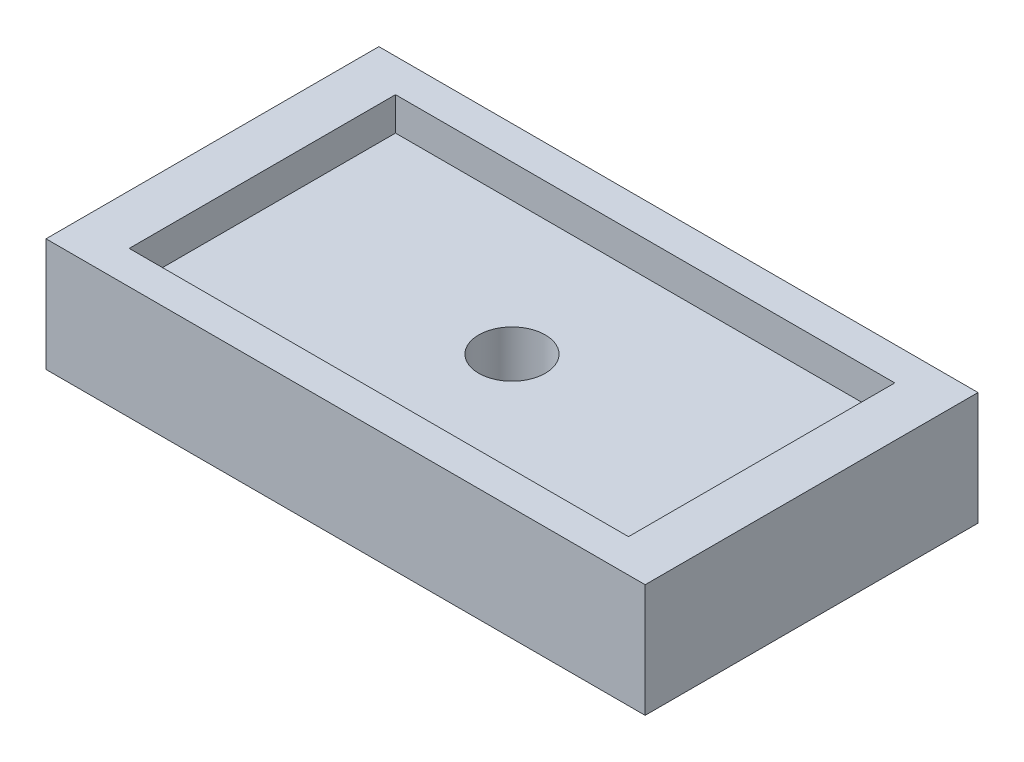
ISO-10303-21;
HEADER;
FILE_DESCRIPTION(('STEP AP214'),'2;1');
FILE_NAME('part.step','',(''),(''),'','','');
FILE_SCHEMA(('AUTOMOTIVE_DESIGN { 1 0 10303 214 1 1 1 1 }'));
ENDSEC;
DATA;
#1=APPLICATION_CONTEXT('core data for automotive mechanical design processes');
#2=APPLICATION_PROTOCOL_DEFINITION('international standard','automotive_design',2000,#1);
#3=PRODUCT_CONTEXT('',#1,'mechanical');
#4=PRODUCT('Part','Part','',(#3));
#5=PRODUCT_RELATED_PRODUCT_CATEGORY('part','',(#4));
#6=PRODUCT_DEFINITION_FORMATION('','',#4);
#7=PRODUCT_DEFINITION_CONTEXT('part definition',#1,'design');
#8=PRODUCT_DEFINITION('design','',#6,#7);
#9=PRODUCT_DEFINITION_SHAPE('','',#8);
#10=(LENGTH_UNIT() NAMED_UNIT(*) SI_UNIT(.MILLI.,.METRE.));
#11=(NAMED_UNIT(*) PLANE_ANGLE_UNIT() SI_UNIT($,.RADIAN.));
#12=(NAMED_UNIT(*) SI_UNIT($,.STERADIAN.) SOLID_ANGLE_UNIT());
#13=UNCERTAINTY_MEASURE_WITH_UNIT(LENGTH_MEASURE(1.E-05),#10,'distance_accuracy_value','');
#14=(GEOMETRIC_REPRESENTATION_CONTEXT(3) GLOBAL_UNCERTAINTY_ASSIGNED_CONTEXT((#13)) GLOBAL_UNIT_ASSIGNED_CONTEXT((#10,
#11,#12)) REPRESENTATION_CONTEXT('',''));
#15=CARTESIAN_POINT('',(0.,0.,0.));
#16=DIRECTION('',(0.,0.,1.));
#17=DIRECTION('',(1.,0.,0.));
#18=AXIS2_PLACEMENT_3D('',#15,#16,#17);
#19=CARTESIAN_POINT('',(0.,17.,0.));
#20=DIRECTION('',(1.,0.,0.));
#21=DIRECTION('',(0.,0.,-1.));
#22=AXIS2_PLACEMENT_3D('',#19,#20,#21);
#23=PLANE('',#22);
#24=DIRECTION('',(0.,0.,1.));
#25=VECTOR('',#24,1.);
#26=CARTESIAN_POINT('',(0.,0.,0.));
#27=LINE('',#26,#25);
#28=CARTESIAN_POINT('',(0.,0.,-50.));
#29=VERTEX_POINT('',#28);
#30=CARTESIAN_POINT('',(0.,0.,0.));
#31=VERTEX_POINT('',#30);
#32=EDGE_CURVE('E146',#29,#31,#27,.T.);
#33=ORIENTED_EDGE('',*,*,#32,.T.);
#34=DIRECTION('',(0.,-1.,0.));
#35=VECTOR('',#34,1.);
#36=CARTESIAN_POINT('',(0.,17.,0.));
#37=LINE('',#36,#35);
#38=CARTESIAN_POINT('',(0.,17.,0.));
#39=VERTEX_POINT('',#38);
#40=EDGE_CURVE('E11',#39,#31,#37,.T.);
#41=ORIENTED_EDGE('',*,*,#40,.F.);
#42=DIRECTION('',(0.,0.,1.));
#43=VECTOR('',#42,1.);
#44=CARTESIAN_POINT('',(0.,17.,0.));
#45=LINE('',#44,#43);
#46=CARTESIAN_POINT('',(0.,17.,-50.));
#47=VERTEX_POINT('',#46);
#48=EDGE_CURVE('E150',#47,#39,#45,.T.);
#49=ORIENTED_EDGE('',*,*,#48,.F.);
#50=DIRECTION('',(0.,-1.,0.));
#51=VECTOR('',#50,1.);
#52=CARTESIAN_POINT('',(0.,17.,-50.));
#53=LINE('',#52,#51);
#54=EDGE_CURVE('E156',#47,#29,#53,.T.);
#55=ORIENTED_EDGE('',*,*,#54,.T.);
#56=EDGE_LOOP('',(#33,#41,#49,#55));
#57=FACE_BOUND('',#56,.T.);
#58=ADVANCED_FACE('F34',(#57),#23,.F.);
#59=CARTESIAN_POINT('',(0.,17.,0.));
#60=DIRECTION('',(0.,0.,-1.));
#61=DIRECTION('',(-1.,0.,0.));
#62=AXIS2_PLACEMENT_3D('',#59,#60,#61);
#63=PLANE('',#62);
#64=DIRECTION('',(1.,0.,0.));
#65=VECTOR('',#64,1.);
#66=CARTESIAN_POINT('',(0.,0.,0.));
#67=LINE('',#66,#65);
#68=CARTESIAN_POINT('',(90.,0.,0.));
#69=VERTEX_POINT('',#68);
#70=EDGE_CURVE('E159',#31,#69,#67,.T.);
#71=ORIENTED_EDGE('',*,*,#70,.T.);
#72=DIRECTION('',(0.,-1.,0.));
#73=VECTOR('',#72,1.);
#74=CARTESIAN_POINT('',(90.,17.,0.));
#75=LINE('',#74,#73);
#76=CARTESIAN_POINT('',(90.,17.,0.));
#77=VERTEX_POINT('',#76);
#78=EDGE_CURVE('E41',#77,#69,#75,.T.);
#79=ORIENTED_EDGE('',*,*,#78,.F.);
#80=DIRECTION('',(1.,0.,0.));
#81=VECTOR('',#80,1.);
#82=CARTESIAN_POINT('',(0.,17.,0.));
#83=LINE('',#82,#81);
#84=EDGE_CURVE('E85',#39,#77,#83,.T.);
#85=ORIENTED_EDGE('',*,*,#84,.F.);
#86=ORIENTED_EDGE('',*,*,#40,.T.);
#87=EDGE_LOOP('',(#71,#79,#85,#86));
#88=FACE_BOUND('',#87,.T.);
#89=ADVANCED_FACE('F188',(#88),#63,.F.);
#90=CARTESIAN_POINT('',(90.,17.,0.));
#91=DIRECTION('',(-1.,0.,0.));
#92=DIRECTION('',(0.,0.,1.));
#93=AXIS2_PLACEMENT_3D('',#90,#91,#92);
#94=PLANE('',#93);
#95=DIRECTION('',(0.,0.,-1.));
#96=VECTOR('',#95,1.);
#97=CARTESIAN_POINT('',(90.,0.,0.));
#98=LINE('',#97,#96);
#99=CARTESIAN_POINT('',(90.,0.,-50.));
#100=VERTEX_POINT('',#99);
#101=EDGE_CURVE('E161',#69,#100,#98,.T.);
#102=ORIENTED_EDGE('',*,*,#101,.T.);
#103=DIRECTION('',(0.,-1.,0.));
#104=VECTOR('',#103,1.);
#105=CARTESIAN_POINT('',(90.,17.,-50.));
#106=LINE('',#105,#104);
#107=CARTESIAN_POINT('',(90.,17.,-50.));
#108=VERTEX_POINT('',#107);
#109=EDGE_CURVE('E165',#108,#100,#106,.T.);
#110=ORIENTED_EDGE('',*,*,#109,.F.);
#111=DIRECTION('',(0.,0.,-1.));
#112=VECTOR('',#111,1.);
#113=CARTESIAN_POINT('',(90.,17.,0.));
#114=LINE('',#113,#112);
#115=EDGE_CURVE('E153',#77,#108,#114,.T.);
#116=ORIENTED_EDGE('',*,*,#115,.F.);
#117=ORIENTED_EDGE('',*,*,#78,.T.);
#118=EDGE_LOOP('',(#102,#110,#116,#117));
#119=FACE_BOUND('',#118,.T.);
#120=ADVANCED_FACE('F170',(#119),#94,.F.);
#121=CARTESIAN_POINT('',(0.,17.,-50.));
#122=DIRECTION('',(0.,0.,1.));
#123=DIRECTION('',(1.,0.,0.));
#124=AXIS2_PLACEMENT_3D('',#121,#122,#123);
#125=PLANE('',#124);
#126=DIRECTION('',(-1.,0.,0.));
#127=VECTOR('',#126,1.);
#128=CARTESIAN_POINT('',(0.,0.,-50.));
#129=LINE('',#128,#127);
#130=EDGE_CURVE('E78',#100,#29,#129,.T.);
#131=ORIENTED_EDGE('',*,*,#130,.T.);
#132=ORIENTED_EDGE('',*,*,#54,.F.);
#133=DIRECTION('',(-1.,0.,0.));
#134=VECTOR('',#133,1.);
#135=CARTESIAN_POINT('',(0.,17.,-50.));
#136=LINE('',#135,#134);
#137=EDGE_CURVE('E57',#108,#47,#136,.T.);
#138=ORIENTED_EDGE('',*,*,#137,.F.);
#139=ORIENTED_EDGE('',*,*,#109,.T.);
#140=EDGE_LOOP('',(#131,#132,#138,#139));
#141=FACE_BOUND('',#140,.T.);
#142=ADVANCED_FACE('F178',(#141),#125,.F.);
#143=CARTESIAN_POINT('',(0.,17.,0.));
#144=DIRECTION('',(0.,-1.,0.));
#145=DIRECTION('',(0.,0.,-1.));
#146=AXIS2_PLACEMENT_3D('',#143,#144,#145);
#147=PLANE('',#146);
#148=DIRECTION('',(1.,0.,0.));
#149=VECTOR('',#148,1.);
#150=CARTESIAN_POINT('',(7.5,17.,-5.));
#151=LINE('',#150,#149);
#152=CARTESIAN_POINT('',(7.5,17.,-5.));
#153=VERTEX_POINT('',#152);
#154=CARTESIAN_POINT('',(82.5,17.,-5.));
#155=VERTEX_POINT('',#154);
#156=EDGE_CURVE('E139',#153,#155,#151,.T.);
#157=ORIENTED_EDGE('',*,*,#156,.F.);
#158=DIRECTION('',(0.,0.,1.));
#159=VECTOR('',#158,1.);
#160=CARTESIAN_POINT('',(7.5,17.,-5.));
#161=LINE('',#160,#159);
#162=CARTESIAN_POINT('',(7.5,17.,-45.));
#163=VERTEX_POINT('',#162);
#164=EDGE_CURVE('E48',#163,#153,#161,.T.);
#165=ORIENTED_EDGE('',*,*,#164,.F.);
#166=DIRECTION('',(-1.,0.,0.));
#167=VECTOR('',#166,1.);
#168=CARTESIAN_POINT('',(7.5,17.,-45.));
#169=LINE('',#168,#167);
#170=CARTESIAN_POINT('',(82.5,17.,-45.));
#171=VERTEX_POINT('',#170);
#172=EDGE_CURVE('E127',#171,#163,#169,.T.);
#173=ORIENTED_EDGE('',*,*,#172,.F.);
#174=DIRECTION('',(0.,0.,-1.));
#175=VECTOR('',#174,1.);
#176=CARTESIAN_POINT('',(82.5,17.,-5.));
#177=LINE('',#176,#175);
#178=EDGE_CURVE('E130',#155,#171,#177,.T.);
#179=ORIENTED_EDGE('',*,*,#178,.F.);
#180=EDGE_LOOP('',(#157,#165,#173,#179));
#181=FACE_BOUND('',#180,.T.);
#182=ORIENTED_EDGE('',*,*,#48,.T.);
#183=ORIENTED_EDGE('',*,*,#84,.T.);
#184=ORIENTED_EDGE('',*,*,#115,.T.);
#185=ORIENTED_EDGE('',*,*,#137,.T.);
#186=EDGE_LOOP('',(#182,#183,#184,#185));
#187=FACE_BOUND('',#186,.T.);
#188=ADVANCED_FACE('F180',(#181,#187),#147,.F.);
#189=CARTESIAN_POINT('',(0.,0.,0.));
#190=DIRECTION('',(0.,-1.,0.));
#191=DIRECTION('',(0.,0.,-1.));
#192=AXIS2_PLACEMENT_3D('',#189,#190,#191);
#193=PLANE('',#192);
#194=CARTESIAN_POINT('',(45.,0.,-25.));
#195=DIRECTION('',(0.,1.,0.));
#196=DIRECTION('',(0.,0.,1.));
#197=AXIS2_PLACEMENT_3D('',#194,#195,#196);
#198=CIRCLE('',#197,5.);
#199=CARTESIAN_POINT('',(45.,0.,-20.));
#200=VERTEX_POINT('',#199);
#201=EDGE_CURVE('E140',#200,#200,#198,.T.);
#202=ORIENTED_EDGE('',*,*,#201,.T.);
#203=EDGE_LOOP('',(#202));
#204=FACE_BOUND('',#203,.T.);
#205=ORIENTED_EDGE('',*,*,#32,.F.);
#206=ORIENTED_EDGE('',*,*,#130,.F.);
#207=ORIENTED_EDGE('',*,*,#101,.F.);
#208=ORIENTED_EDGE('',*,*,#70,.F.);
#209=EDGE_LOOP('',(#205,#206,#207,#208));
#210=FACE_BOUND('',#209,.T.);
#211=ADVANCED_FACE('F174',(#204,#210),#193,.T.);
#212=CARTESIAN_POINT('',(7.5,12.,-5.));
#213=DIRECTION('',(-1.,0.,0.));
#214=DIRECTION('',(0.,0.,1.));
#215=AXIS2_PLACEMENT_3D('',#212,#213,#214);
#216=PLANE('',#215);
#217=ORIENTED_EDGE('',*,*,#164,.T.);
#218=DIRECTION('',(0.,1.,0.));
#219=VECTOR('',#218,1.);
#220=CARTESIAN_POINT('',(7.5,12.,-5.));
#221=LINE('',#220,#219);
#222=CARTESIAN_POINT('',(7.5,12.,-5.));
#223=VERTEX_POINT('',#222);
#224=EDGE_CURVE('E105',#223,#153,#221,.T.);
#225=ORIENTED_EDGE('',*,*,#224,.F.);
#226=DIRECTION('',(0.,0.,1.));
#227=VECTOR('',#226,1.);
#228=CARTESIAN_POINT('',(7.5,12.,-5.));
#229=LINE('',#228,#227);
#230=CARTESIAN_POINT('',(7.5,12.,-45.));
#231=VERTEX_POINT('',#230);
#232=EDGE_CURVE('E109',#231,#223,#229,.T.);
#233=ORIENTED_EDGE('',*,*,#232,.F.);
#234=DIRECTION('',(0.,1.,0.));
#235=VECTOR('',#234,1.);
#236=CARTESIAN_POINT('',(7.5,12.,-45.));
#237=LINE('',#236,#235);
#238=EDGE_CURVE('E144',#231,#163,#237,.T.);
#239=ORIENTED_EDGE('',*,*,#238,.T.);
#240=EDGE_LOOP('',(#217,#225,#233,#239));
#241=FACE_BOUND('',#240,.T.);
#242=ADVANCED_FACE('F107',(#241),#216,.F.);
#243=CARTESIAN_POINT('',(7.5,12.,-45.));
#244=DIRECTION('',(0.,0.,-1.));
#245=DIRECTION('',(-1.,0.,0.));
#246=AXIS2_PLACEMENT_3D('',#243,#244,#245);
#247=PLANE('',#246);
#248=ORIENTED_EDGE('',*,*,#172,.T.);
#249=ORIENTED_EDGE('',*,*,#238,.F.);
#250=DIRECTION('',(-1.,0.,0.));
#251=VECTOR('',#250,1.);
#252=CARTESIAN_POINT('',(7.5,12.,-45.));
#253=LINE('',#252,#251);
#254=CARTESIAN_POINT('',(82.5,12.,-45.));
#255=VERTEX_POINT('',#254);
#256=EDGE_CURVE('E115',#255,#231,#253,.T.);
#257=ORIENTED_EDGE('',*,*,#256,.F.);
#258=DIRECTION('',(0.,1.,0.));
#259=VECTOR('',#258,1.);
#260=CARTESIAN_POINT('',(82.5,12.,-45.));
#261=LINE('',#260,#259);
#262=EDGE_CURVE('E147',#255,#171,#261,.T.);
#263=ORIENTED_EDGE('',*,*,#262,.T.);
#264=EDGE_LOOP('',(#248,#249,#257,#263));
#265=FACE_BOUND('',#264,.T.);
#266=ADVANCED_FACE('F222',(#265),#247,.F.);
#267=CARTESIAN_POINT('',(82.5,12.,-5.));
#268=DIRECTION('',(1.,0.,0.));
#269=DIRECTION('',(0.,0.,-1.));
#270=AXIS2_PLACEMENT_3D('',#267,#268,#269);
#271=PLANE('',#270);
#272=ORIENTED_EDGE('',*,*,#178,.T.);
#273=ORIENTED_EDGE('',*,*,#262,.F.);
#274=DIRECTION('',(0.,0.,-1.));
#275=VECTOR('',#274,1.);
#276=CARTESIAN_POINT('',(82.5,12.,-5.));
#277=LINE('',#276,#275);
#278=CARTESIAN_POINT('',(82.5,12.,-5.));
#279=VERTEX_POINT('',#278);
#280=EDGE_CURVE('E123',#279,#255,#277,.T.);
#281=ORIENTED_EDGE('',*,*,#280,.F.);
#282=DIRECTION('',(0.,1.,0.));
#283=VECTOR('',#282,1.);
#284=CARTESIAN_POINT('',(82.5,12.,-5.));
#285=LINE('',#284,#283);
#286=EDGE_CURVE('E114',#279,#155,#285,.T.);
#287=ORIENTED_EDGE('',*,*,#286,.T.);
#288=EDGE_LOOP('',(#272,#273,#281,#287));
#289=FACE_BOUND('',#288,.T.);
#290=ADVANCED_FACE('F231',(#289),#271,.F.);
#291=CARTESIAN_POINT('',(7.5,12.,-5.));
#292=DIRECTION('',(0.,0.,1.));
#293=DIRECTION('',(1.,0.,0.));
#294=AXIS2_PLACEMENT_3D('',#291,#292,#293);
#295=PLANE('',#294);
#296=ORIENTED_EDGE('',*,*,#156,.T.);
#297=ORIENTED_EDGE('',*,*,#286,.F.);
#298=DIRECTION('',(1.,0.,0.));
#299=VECTOR('',#298,1.);
#300=CARTESIAN_POINT('',(7.5,12.,-5.));
#301=LINE('',#300,#299);
#302=EDGE_CURVE('E118',#223,#279,#301,.T.);
#303=ORIENTED_EDGE('',*,*,#302,.F.);
#304=ORIENTED_EDGE('',*,*,#224,.T.);
#305=EDGE_LOOP('',(#296,#297,#303,#304));
#306=FACE_BOUND('',#305,.T.);
#307=ADVANCED_FACE('F119',(#306),#295,.F.);
#308=CARTESIAN_POINT('',(0.,12.,0.));
#309=DIRECTION('',(0.,-1.,0.));
#310=DIRECTION('',(0.,0.,-1.));
#311=AXIS2_PLACEMENT_3D('',#308,#309,#310);
#312=PLANE('',#311);
#313=CARTESIAN_POINT('',(45.,12.,-25.));
#314=DIRECTION('',(0.,1.,0.));
#315=DIRECTION('',(0.,0.,1.));
#316=AXIS2_PLACEMENT_3D('',#313,#314,#315);
#317=CIRCLE('',#316,5.);
#318=CARTESIAN_POINT('',(45.,12.,-20.));
#319=VERTEX_POINT('',#318);
#320=EDGE_CURVE('E133',#319,#319,#317,.T.);
#321=ORIENTED_EDGE('',*,*,#320,.F.);
#322=EDGE_LOOP('',(#321));
#323=FACE_BOUND('',#322,.T.);
#324=ORIENTED_EDGE('',*,*,#232,.T.);
#325=ORIENTED_EDGE('',*,*,#302,.T.);
#326=ORIENTED_EDGE('',*,*,#280,.T.);
#327=ORIENTED_EDGE('',*,*,#256,.T.);
#328=EDGE_LOOP('',(#324,#325,#326,#327));
#329=FACE_BOUND('',#328,.T.);
#330=ADVANCED_FACE('F125',(#323,#329),#312,.F.);
#331=CARTESIAN_POINT('',(45.,0.,-25.));
#332=DIRECTION('',(0.,1.,0.));
#333=DIRECTION('',(0.,0.,1.));
#334=AXIS2_PLACEMENT_3D('',#331,#332,#333);
#335=CYLINDRICAL_SURFACE('',#334,5.);
#336=ORIENTED_EDGE('',*,*,#201,.F.);
#337=EDGE_LOOP('',(#336));
#338=FACE_BOUND('',#337,.T.);
#339=ORIENTED_EDGE('',*,*,#320,.T.);
#340=EDGE_LOOP('',(#339));
#341=FACE_BOUND('',#340,.T.);
#342=ADVANCED_FACE('F264',(#338,#341),#335,.F.);
#343=CLOSED_SHELL('',(#58,#89,#120,#142,#188,#211,#242,#266,#290,#307,#330,#342));
#344=MANIFOLD_SOLID_BREP('B2',#343);
#345=ADVANCED_BREP_SHAPE_REPRESENTATION('',(#18,#344),#14);
#346=SHAPE_DEFINITION_REPRESENTATION(#9,#345);
ENDSEC;
END-ISO-10303-21;
